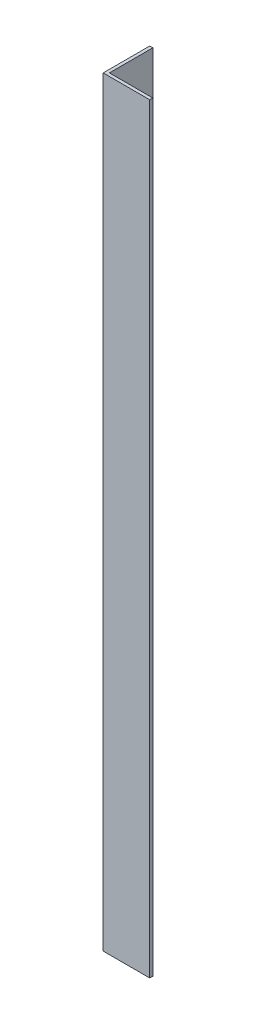
ISO-10303-21;
HEADER;
FILE_DESCRIPTION(('STEP AP214'),'2;1');
FILE_NAME('part.step','',(''),(''),'','','');
FILE_SCHEMA(('AUTOMOTIVE_DESIGN { 1 0 10303 214 1 1 1 1 }'));
ENDSEC;
DATA;
#1=APPLICATION_CONTEXT('core data for automotive mechanical design processes');
#2=APPLICATION_PROTOCOL_DEFINITION('international standard','automotive_design',2000,#1);
#3=PRODUCT_CONTEXT('',#1,'mechanical');
#4=PRODUCT('Part','Part','',(#3));
#5=PRODUCT_RELATED_PRODUCT_CATEGORY('part','',(#4));
#6=PRODUCT_DEFINITION_FORMATION('','',#4);
#7=PRODUCT_DEFINITION_CONTEXT('part definition',#1,'design');
#8=PRODUCT_DEFINITION('design','',#6,#7);
#9=PRODUCT_DEFINITION_SHAPE('','',#8);
#10=(LENGTH_UNIT() NAMED_UNIT(*) SI_UNIT(.MILLI.,.METRE.));
#11=(NAMED_UNIT(*) PLANE_ANGLE_UNIT() SI_UNIT($,.RADIAN.));
#12=(NAMED_UNIT(*) SI_UNIT($,.STERADIAN.) SOLID_ANGLE_UNIT());
#13=UNCERTAINTY_MEASURE_WITH_UNIT(LENGTH_MEASURE(1.E-05),#10,'distance_accuracy_value','');
#14=(GEOMETRIC_REPRESENTATION_CONTEXT(3) GLOBAL_UNCERTAINTY_ASSIGNED_CONTEXT((#13)) GLOBAL_UNIT_ASSIGNED_CONTEXT((#10,
#11,#12)) REPRESENTATION_CONTEXT('',''));
#15=CARTESIAN_POINT('',(0.,0.,0.));
#16=DIRECTION('',(0.,0.,1.));
#17=DIRECTION('',(1.,0.,0.));
#18=AXIS2_PLACEMENT_3D('',#15,#16,#17);
#19=CARTESIAN_POINT('',(15.,245.,0.));
#20=DIRECTION('',(0.,0.,-1.));
#21=DIRECTION('',(-1.,0.,0.));
#22=AXIS2_PLACEMENT_3D('',#19,#20,#21);
#23=PLANE('',#22);
#24=DIRECTION('',(1.,0.,0.));
#25=VECTOR('',#24,1.);
#26=CARTESIAN_POINT('',(15.,0.,0.));
#27=LINE('',#26,#25);
#28=CARTESIAN_POINT('',(0.,0.,0.));
#29=VERTEX_POINT('',#28);
#30=CARTESIAN_POINT('',(15.,0.,0.));
#31=VERTEX_POINT('',#30);
#32=EDGE_CURVE('E121',#29,#31,#27,.T.);
#33=ORIENTED_EDGE('',*,*,#32,.T.);
#34=DIRECTION('',(0.,-1.,0.));
#35=VECTOR('',#34,1.);
#36=CARTESIAN_POINT('',(15.,245.,0.));
#37=LINE('',#36,#35);
#38=CARTESIAN_POINT('',(15.,245.,0.));
#39=VERTEX_POINT('',#38);
#40=EDGE_CURVE('E11',#39,#31,#37,.T.);
#41=ORIENTED_EDGE('',*,*,#40,.F.);
#42=DIRECTION('',(1.,0.,0.));
#43=VECTOR('',#42,1.);
#44=CARTESIAN_POINT('',(15.,245.,0.));
#45=LINE('',#44,#43);
#46=CARTESIAN_POINT('',(0.,245.,0.));
#47=VERTEX_POINT('',#46);
#48=EDGE_CURVE('E131',#47,#39,#45,.T.);
#49=ORIENTED_EDGE('',*,*,#48,.F.);
#50=DIRECTION('',(0.,-1.,0.));
#51=VECTOR('',#50,1.);
#52=CARTESIAN_POINT('',(0.,245.,0.));
#53=LINE('',#52,#51);
#54=EDGE_CURVE('E117',#47,#29,#53,.T.);
#55=ORIENTED_EDGE('',*,*,#54,.T.);
#56=EDGE_LOOP('',(#33,#41,#49,#55));
#57=FACE_BOUND('',#56,.T.);
#58=ADVANCED_FACE('F37',(#57),#23,.F.);
#59=CARTESIAN_POINT('',(15.,245.,-0.999999999999998));
#60=DIRECTION('',(-1.,0.,0.));
#61=DIRECTION('',(0.,0.,1.));
#62=AXIS2_PLACEMENT_3D('',#59,#60,#61);
#63=PLANE('',#62);
#64=DIRECTION('',(0.,0.,-1.));
#65=VECTOR('',#64,1.);
#66=CARTESIAN_POINT('',(15.,0.,-0.999999999999998));
#67=LINE('',#66,#65);
#68=CARTESIAN_POINT('',(15.,0.,-0.999999999999998));
#69=VERTEX_POINT('',#68);
#70=EDGE_CURVE('E124',#31,#69,#67,.T.);
#71=ORIENTED_EDGE('',*,*,#70,.T.);
#72=DIRECTION('',(0.,-1.,0.));
#73=VECTOR('',#72,1.);
#74=CARTESIAN_POINT('',(15.,245.,-0.999999999999998));
#75=LINE('',#74,#73);
#76=CARTESIAN_POINT('',(15.,245.,-0.999999999999998));
#77=VERTEX_POINT('',#76);
#78=EDGE_CURVE('E45',#77,#69,#75,.T.);
#79=ORIENTED_EDGE('',*,*,#78,.F.);
#80=DIRECTION('',(0.,0.,-1.));
#81=VECTOR('',#80,1.);
#82=CARTESIAN_POINT('',(15.,245.,-0.999999999999998));
#83=LINE('',#82,#81);
#84=EDGE_CURVE('E90',#39,#77,#83,.T.);
#85=ORIENTED_EDGE('',*,*,#84,.F.);
#86=ORIENTED_EDGE('',*,*,#40,.T.);
#87=EDGE_LOOP('',(#71,#79,#85,#86));
#88=FACE_BOUND('',#87,.T.);
#89=ADVANCED_FACE('F155',(#88),#63,.F.);
#90=CARTESIAN_POINT('',(1.,245.,-0.999999999999997));
#91=DIRECTION('',(0.,0.,1.));
#92=DIRECTION('',(1.,0.,0.));
#93=AXIS2_PLACEMENT_3D('',#90,#91,#92);
#94=PLANE('',#93);
#95=DIRECTION('',(-1.,0.,0.));
#96=VECTOR('',#95,1.);
#97=CARTESIAN_POINT('',(1.,0.,-0.999999999999997));
#98=LINE('',#97,#96);
#99=CARTESIAN_POINT('',(1.,0.,-0.999999999999997));
#100=VERTEX_POINT('',#99);
#101=EDGE_CURVE('E126',#69,#100,#98,.T.);
#102=ORIENTED_EDGE('',*,*,#101,.T.);
#103=DIRECTION('',(0.,-1.,0.));
#104=VECTOR('',#103,1.);
#105=CARTESIAN_POINT('',(1.,245.,-0.999999999999997));
#106=LINE('',#105,#104);
#107=CARTESIAN_POINT('',(1.,245.,-0.999999999999997));
#108=VERTEX_POINT('',#107);
#109=EDGE_CURVE('E112',#108,#100,#106,.T.);
#110=ORIENTED_EDGE('',*,*,#109,.F.);
#111=DIRECTION('',(-1.,0.,0.));
#112=VECTOR('',#111,1.);
#113=CARTESIAN_POINT('',(1.,245.,-0.999999999999997));
#114=LINE('',#113,#112);
#115=EDGE_CURVE('E103',#77,#108,#114,.T.);
#116=ORIENTED_EDGE('',*,*,#115,.F.);
#117=ORIENTED_EDGE('',*,*,#78,.T.);
#118=EDGE_LOOP('',(#102,#110,#116,#117));
#119=FACE_BOUND('',#118,.T.);
#120=ADVANCED_FACE('F137',(#119),#94,.F.);
#121=CARTESIAN_POINT('',(0.999999999999998,245.,-15.));
#122=DIRECTION('',(-1.,0.,0.));
#123=DIRECTION('',(0.,0.,1.));
#124=AXIS2_PLACEMENT_3D('',#121,#122,#123);
#125=PLANE('',#124);
#126=DIRECTION('',(0.,0.,-1.));
#127=VECTOR('',#126,1.);
#128=CARTESIAN_POINT('',(0.999999999999998,0.,-15.));
#129=LINE('',#128,#127);
#130=CARTESIAN_POINT('',(0.999999999999998,0.,-15.));
#131=VERTEX_POINT('',#130);
#132=EDGE_CURVE('E111',#100,#131,#129,.T.);
#133=ORIENTED_EDGE('',*,*,#132,.T.);
#134=DIRECTION('',(0.,-1.,0.));
#135=VECTOR('',#134,1.);
#136=CARTESIAN_POINT('',(0.999999999999998,245.,-15.));
#137=LINE('',#136,#135);
#138=CARTESIAN_POINT('',(0.999999999999998,245.,-15.));
#139=VERTEX_POINT('',#138);
#140=EDGE_CURVE('E108',#139,#131,#137,.T.);
#141=ORIENTED_EDGE('',*,*,#140,.F.);
#142=DIRECTION('',(0.,0.,-1.));
#143=VECTOR('',#142,1.);
#144=CARTESIAN_POINT('',(0.999999999999998,245.,-15.));
#145=LINE('',#144,#143);
#146=EDGE_CURVE('E97',#108,#139,#145,.T.);
#147=ORIENTED_EDGE('',*,*,#146,.F.);
#148=ORIENTED_EDGE('',*,*,#109,.T.);
#149=EDGE_LOOP('',(#133,#141,#147,#148));
#150=FACE_BOUND('',#149,.T.);
#151=ADVANCED_FACE('F109',(#150),#125,.F.);
#152=CARTESIAN_POINT('',(0.,245.,-15.));
#153=DIRECTION('',(0.,0.,1.));
#154=DIRECTION('',(1.,0.,0.));
#155=AXIS2_PLACEMENT_3D('',#152,#153,#154);
#156=PLANE('',#155);
#157=DIRECTION('',(-1.,0.,0.));
#158=VECTOR('',#157,1.);
#159=CARTESIAN_POINT('',(0.,0.,-15.));
#160=LINE('',#159,#158);
#161=CARTESIAN_POINT('',(0.,0.,-15.));
#162=VERTEX_POINT('',#161);
#163=EDGE_CURVE('E76',#131,#162,#160,.T.);
#164=ORIENTED_EDGE('',*,*,#163,.T.);
#165=DIRECTION('',(0.,-1.,0.));
#166=VECTOR('',#165,1.);
#167=CARTESIAN_POINT('',(0.,245.,-15.));
#168=LINE('',#167,#166);
#169=CARTESIAN_POINT('',(0.,245.,-15.));
#170=VERTEX_POINT('',#169);
#171=EDGE_CURVE('E113',#170,#162,#168,.T.);
#172=ORIENTED_EDGE('',*,*,#171,.F.);
#173=DIRECTION('',(-1.,0.,0.));
#174=VECTOR('',#173,1.);
#175=CARTESIAN_POINT('',(0.,245.,-15.));
#176=LINE('',#175,#174);
#177=EDGE_CURVE('E101',#139,#170,#176,.T.);
#178=ORIENTED_EDGE('',*,*,#177,.F.);
#179=ORIENTED_EDGE('',*,*,#140,.T.);
#180=EDGE_LOOP('',(#164,#172,#178,#179));
#181=FACE_BOUND('',#180,.T.);
#182=ADVANCED_FACE('F115',(#181),#156,.F.);
#183=CARTESIAN_POINT('',(0.,245.,0.));
#184=DIRECTION('',(1.,0.,0.));
#185=DIRECTION('',(0.,0.,-1.));
#186=AXIS2_PLACEMENT_3D('',#183,#184,#185);
#187=PLANE('',#186);
#188=DIRECTION('',(0.,0.,1.));
#189=VECTOR('',#188,1.);
#190=CARTESIAN_POINT('',(0.,0.,0.));
#191=LINE('',#190,#189);
#192=EDGE_CURVE('E82',#162,#29,#191,.T.);
#193=ORIENTED_EDGE('',*,*,#192,.T.);
#194=ORIENTED_EDGE('',*,*,#54,.F.);
#195=DIRECTION('',(0.,0.,1.));
#196=VECTOR('',#195,1.);
#197=CARTESIAN_POINT('',(0.,245.,0.));
#198=LINE('',#197,#196);
#199=EDGE_CURVE('E53',#170,#47,#198,.T.);
#200=ORIENTED_EDGE('',*,*,#199,.F.);
#201=ORIENTED_EDGE('',*,*,#171,.T.);
#202=EDGE_LOOP('',(#193,#194,#200,#201));
#203=FACE_BOUND('',#202,.T.);
#204=ADVANCED_FACE('F144',(#203),#187,.F.);
#205=CARTESIAN_POINT('',(0.,245.,0.));
#206=DIRECTION('',(0.,-1.,0.));
#207=DIRECTION('',(0.,0.,-1.));
#208=AXIS2_PLACEMENT_3D('',#205,#206,#207);
#209=PLANE('',#208);
#210=ORIENTED_EDGE('',*,*,#48,.T.);
#211=ORIENTED_EDGE('',*,*,#84,.T.);
#212=ORIENTED_EDGE('',*,*,#115,.T.);
#213=ORIENTED_EDGE('',*,*,#146,.T.);
#214=ORIENTED_EDGE('',*,*,#177,.T.);
#215=ORIENTED_EDGE('',*,*,#199,.T.);
#216=EDGE_LOOP('',(#210,#211,#212,#213,#214,#215));
#217=FACE_BOUND('',#216,.T.);
#218=ADVANCED_FACE('F99',(#217),#209,.F.);
#219=CARTESIAN_POINT('',(0.,0.,0.));
#220=DIRECTION('',(0.,-1.,0.));
#221=DIRECTION('',(0.,0.,-1.));
#222=AXIS2_PLACEMENT_3D('',#219,#220,#221);
#223=PLANE('',#222);
#224=ORIENTED_EDGE('',*,*,#32,.F.);
#225=ORIENTED_EDGE('',*,*,#192,.F.);
#226=ORIENTED_EDGE('',*,*,#163,.F.);
#227=ORIENTED_EDGE('',*,*,#132,.F.);
#228=ORIENTED_EDGE('',*,*,#101,.F.);
#229=ORIENTED_EDGE('',*,*,#70,.F.);
#230=EDGE_LOOP('',(#224,#225,#226,#227,#228,#229));
#231=FACE_BOUND('',#230,.T.);
#232=ADVANCED_FACE('F140',(#231),#223,.T.);
#233=CLOSED_SHELL('',(#58,#89,#120,#151,#182,#204,#218,#232));
#234=MANIFOLD_SOLID_BREP('B2',#233);
#235=ADVANCED_BREP_SHAPE_REPRESENTATION('',(#18,#234),#14);
#236=SHAPE_DEFINITION_REPRESENTATION(#9,#235);
ENDSEC;
END-ISO-10303-21;
